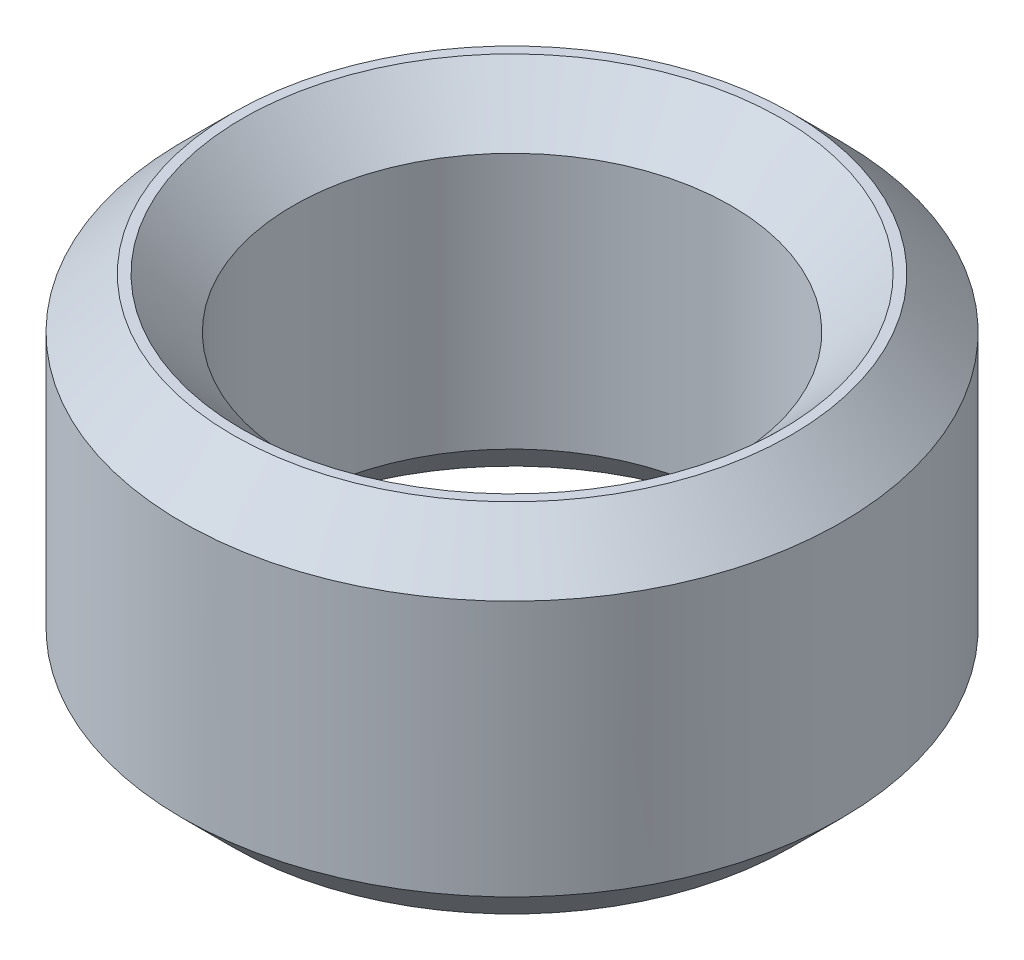
ISO-10303-21;
HEADER;
FILE_DESCRIPTION(('STEP AP214'),'2;1');
FILE_NAME('part.step','',(''),(''),'','','');
FILE_SCHEMA(('AUTOMOTIVE_DESIGN { 1 0 10303 214 1 1 1 1 }'));
ENDSEC;
DATA;
#1=APPLICATION_CONTEXT('core data for automotive mechanical design processes');
#2=APPLICATION_PROTOCOL_DEFINITION('international standard','automotive_design',2000,#1);
#3=PRODUCT_CONTEXT('',#1,'mechanical');
#4=PRODUCT('Part','Part','',(#3));
#5=PRODUCT_RELATED_PRODUCT_CATEGORY('part','',(#4));
#6=PRODUCT_DEFINITION_FORMATION('','',#4);
#7=PRODUCT_DEFINITION_CONTEXT('part definition',#1,'design');
#8=PRODUCT_DEFINITION('design','',#6,#7);
#9=PRODUCT_DEFINITION_SHAPE('','',#8);
#10=(LENGTH_UNIT() NAMED_UNIT(*) SI_UNIT(.MILLI.,.METRE.));
#11=(NAMED_UNIT(*) PLANE_ANGLE_UNIT() SI_UNIT($,.RADIAN.));
#12=(NAMED_UNIT(*) SI_UNIT($,.STERADIAN.) SOLID_ANGLE_UNIT());
#13=UNCERTAINTY_MEASURE_WITH_UNIT(LENGTH_MEASURE(1.E-05),#10,'distance_accuracy_value','');
#14=(GEOMETRIC_REPRESENTATION_CONTEXT(3) GLOBAL_UNCERTAINTY_ASSIGNED_CONTEXT((#13)) GLOBAL_UNIT_ASSIGNED_CONTEXT((#10,
#11,#12)) REPRESENTATION_CONTEXT('',''));
#15=CARTESIAN_POINT('',(0.,0.,0.));
#16=DIRECTION('',(0.,0.,1.));
#17=DIRECTION('',(1.,0.,0.));
#18=AXIS2_PLACEMENT_3D('',#15,#16,#17);
#19=CARTESIAN_POINT('',(0.,21.6633257304632,0.));
#20=DIRECTION('',(0.,-1.,0.));
#21=DIRECTION('',(0.,0.,-1.));
#22=AXIS2_PLACEMENT_3D('',#19,#20,#21);
#23=CYLINDRICAL_SURFACE('',#22,20.);
#24=CARTESIAN_POINT('',(0.,3.06001390784259,0.));
#25=DIRECTION('',(0.,1.,0.));
#26=DIRECTION('',(0.,0.,1.));
#27=AXIS2_PLACEMENT_3D('',#24,#25,#26);
#28=CIRCLE('',#27,20.);
#29=CARTESIAN_POINT('',(0.,3.06001390784259,-20.));
#30=VERTEX_POINT('',#29);
#31=EDGE_CURVE('E10',#30,#30,#28,.T.);
#32=CARTESIAN_POINT('',(0.,18.6033118226206,0.));
#33=DIRECTION('',(0.,1.,0.));
#34=DIRECTION('',(0.,0.,1.));
#35=AXIS2_PLACEMENT_3D('',#32,#33,#34);
#36=CIRCLE('',#35,20.);
#37=CARTESIAN_POINT('',(0.,18.6033118226206,-20.));
#38=VERTEX_POINT('',#37);
#39=EDGE_CURVE('E50',#38,#38,#36,.F.);
#40=CARTESIAN_POINT('',(0.,3.06001390784259,-20.));
#41=CARTESIAN_POINT('',(0.,3.22192326112152,-20.));
#42=CARTESIAN_POINT('',(0.,3.38383261440046,-20.));
#43=CARTESIAN_POINT('',(0.,3.70765132095834,-20.));
#44=CARTESIAN_POINT('',(0.,3.86956067423728,-20.));
#45=CARTESIAN_POINT('',(0.,4.19337938079515,-20.));
#46=CARTESIAN_POINT('',(0.,4.35528873407409,-20.));
#47=CARTESIAN_POINT('',(0.,4.67910744063197,-20.));
#48=CARTESIAN_POINT('',(0.,4.8410167939109,-20.));
#49=CARTESIAN_POINT('',(0.,5.16483550046878,-20.));
#50=CARTESIAN_POINT('',(0.,5.32674485374772,-20.));
#51=CARTESIAN_POINT('',(0.,5.65056356030559,-20.));
#52=CARTESIAN_POINT('',(0.,5.81247291358453,-20.));
#53=CARTESIAN_POINT('',(0.,6.13629162014241,-20.));
#54=CARTESIAN_POINT('',(0.,6.29820097342134,-20.));
#55=CARTESIAN_POINT('',(0.,6.62201967997922,-20.));
#56=CARTESIAN_POINT('',(0.,6.78392903325815,-20.));
#57=CARTESIAN_POINT('',(0.,7.10774773981603,-20.));
#58=CARTESIAN_POINT('',(0.,7.26965709309497,-20.));
#59=CARTESIAN_POINT('',(0.,7.59347579965284,-20.));
#60=CARTESIAN_POINT('',(0.,7.75538515293178,-20.));
#61=CARTESIAN_POINT('',(0.,8.07920385948966,-20.));
#62=CARTESIAN_POINT('',(0.,8.2411132127686,-20.));
#63=CARTESIAN_POINT('',(0.,8.56493191932647,-20.));
#64=CARTESIAN_POINT('',(0.,8.72684127260541,-20.));
#65=CARTESIAN_POINT('',(0.,9.05065997916329,-20.));
#66=CARTESIAN_POINT('',(0.,9.21256933244222,-20.));
#67=CARTESIAN_POINT('',(0.,9.5363880390001,-20.));
#68=CARTESIAN_POINT('',(0.,9.69829739227904,-20.));
#69=CARTESIAN_POINT('',(0.,10.0221160988369,-20.));
#70=CARTESIAN_POINT('',(0.,10.1840254521159,-20.));
#71=CARTESIAN_POINT('',(0.,10.5078441586737,-20.));
#72=CARTESIAN_POINT('',(0.,10.6697535119527,-20.));
#73=CARTESIAN_POINT('',(0.,10.9935722185105,-20.));
#74=CARTESIAN_POINT('',(0.,11.1554815717895,-20.));
#75=CARTESIAN_POINT('',(0.,11.4793002783474,-20.));
#76=CARTESIAN_POINT('',(0.,11.6412096316263,-20.));
#77=CARTESIAN_POINT('',(0.,11.9650283381842,-20.));
#78=CARTESIAN_POINT('',(0.,12.1269376914631,-20.));
#79=CARTESIAN_POINT('',(0.,12.450756398021,-20.));
#80=CARTESIAN_POINT('',(0.,12.6126657512999,-20.));
#81=CARTESIAN_POINT('',(0.,12.9364844578578,-20.));
#82=CARTESIAN_POINT('',(0.,13.0983938111367,-20.));
#83=CARTESIAN_POINT('',(0.,13.4222125176946,-20.));
#84=CARTESIAN_POINT('',(0.,13.5841218709735,-20.));
#85=CARTESIAN_POINT('',(0.,13.9079405775314,-20.));
#86=CARTESIAN_POINT('',(0.,14.0698499308104,-20.));
#87=CARTESIAN_POINT('',(0.,14.3936686373682,-20.));
#88=CARTESIAN_POINT('',(0.,14.5555779906472,-20.));
#89=CARTESIAN_POINT('',(0.,14.879396697205,-20.));
#90=CARTESIAN_POINT('',(0.,15.041306050484,-20.));
#91=CARTESIAN_POINT('',(0.,15.3651247570419,-20.));
#92=CARTESIAN_POINT('',(0.,15.5270341103208,-20.));
#93=CARTESIAN_POINT('',(0.,15.8508528168787,-20.));
#94=CARTESIAN_POINT('',(0.,16.0127621701576,-20.));
#95=CARTESIAN_POINT('',(0.,16.3365808767155,-20.));
#96=CARTESIAN_POINT('',(0.,16.4984902299944,-20.));
#97=CARTESIAN_POINT('',(0.,16.8223089365523,-20.));
#98=CARTESIAN_POINT('',(0.,16.9842182898312,-20.));
#99=CARTESIAN_POINT('',(0.,17.3080369963891,-20.));
#100=CARTESIAN_POINT('',(0.,17.4699463496681,-20.));
#101=CARTESIAN_POINT('',(0.,17.7937650562259,-20.));
#102=CARTESIAN_POINT('',(0.,17.9556744095049,-20.));
#103=CARTESIAN_POINT('',(0.,18.2794931160627,-20.));
#104=CARTESIAN_POINT('',(0.,18.4414024693417,-20.));
#105=CARTESIAN_POINT('',(0.,18.6033118226206,-20.));
#106=B_SPLINE_CURVE_WITH_KNOTS('',3,(#40,#41,#42,#43,#44,#45,#46,#47,#48,#49,#50,#51,#52,#53,
#54,#55,#56,#57,#58,#59,#60,#61,#62,#63,#64,#65,#66,#67,#68,#69,#70,#71,#72,#73,#74,#75,#76,#77,
#78,#79,#80,#81,#82,#83,#84,#85,#86,#87,#88,#89,#90,#91,#92,#93,#94,#95,#96,#97,#98,#99,#100,
#101,#102,#103,#104,#105),.UNSPECIFIED.,.F.,.F.,(4,2,2,2,2,2,2,2,2,2,2,2,2,2,2,2,2,2,2,2,2,2,2,
2,2,2,2,2,2,2,2,2,4),(0.,0.485728059836814,0.971456119673628,1.45718417951044,1.94291223934726,
2.42864029918407,2.91436835902088,3.40009641885769,3.88582447869451,4.37155253853132,
4.85728059836813,5.34300865820495,5.82873671804176,6.31446477787857,6.80019283771539,
7.2859208975522,7.77164895738902,8.25737701722583,8.74310507706264,9.22883313689946,
9.71456119673627,10.2002892565731,10.6860173164099,11.1717453762467,11.6574734360835,
12.1432014959203,12.6289295557571,13.114657615594,13.6003856754308,14.0861137352676,
14.5718417951044,15.0575698549412,15.543297914778),.UNSPECIFIED.);
#107=EDGE_CURVE('BSEAM39',#30,#38,#106,.T.);
#108=ORIENTED_EDGE('',*,*,#31,.T.);
#109=ORIENTED_EDGE('',*,*,#39,.T.);
#110=ORIENTED_EDGE('',*,*,#107,.T.);
#111=ORIENTED_EDGE('',*,*,#107,.F.);
#112=EDGE_LOOP('',(#108,#110,#109,#111));
#113=FACE_BOUND('',#112,.T.);
#114=ADVANCED_FACE('F39',(#113),#23,.T.);
#115=CARTESIAN_POINT('',(0.,21.6633257304632,0.));
#116=DIRECTION('',(0.,1.,0.));
#117=DIRECTION('',(0.,0.,1.));
#118=AXIS2_PLACEMENT_3D('',#115,#116,#117);
#119=PLANE('',#118);
#120=CARTESIAN_POINT('',(0.,21.6633257304632,0.));
#121=DIRECTION('',(0.,1.,0.));
#122=DIRECTION('',(0.,0.,1.));
#123=AXIS2_PLACEMENT_3D('',#120,#121,#122);
#124=CIRCLE('',#123,16.3518396871364);
#125=CARTESIAN_POINT('',(0.,21.6633257304632,16.3518396871364));
#126=VERTEX_POINT('',#125);
#127=EDGE_CURVE('E58',#126,#126,#124,.F.);
#128=ORIENTED_EDGE('',*,*,#127,.T.);
#129=EDGE_LOOP('',(#128));
#130=FACE_BOUND('',#129,.T.);
#131=CARTESIAN_POINT('',(0.,21.6633257304632,0.));
#132=DIRECTION('',(0.,1.,0.));
#133=DIRECTION('',(0.,0.,1.));
#134=AXIS2_PLACEMENT_3D('',#131,#132,#133);
#135=CIRCLE('',#134,16.9399860921575);
#136=CARTESIAN_POINT('',(0.,21.6633257304632,-16.9399860921575));
#137=VERTEX_POINT('',#136);
#138=EDGE_CURVE('E61',#137,#137,#135,.T.);
#139=ORIENTED_EDGE('',*,*,#138,.T.);
#140=EDGE_LOOP('',(#139));
#141=FACE_BOUND('',#140,.T.);
#142=ADVANCED_FACE('F88',(#130,#141),#119,.T.);
#143=CARTESIAN_POINT('',(0.,0.,0.));
#144=DIRECTION('',(0.,1.,0.));
#145=DIRECTION('',(0.,0.,1.));
#146=AXIS2_PLACEMENT_3D('',#143,#144,#145);
#147=PLANE('',#146);
#148=CARTESIAN_POINT('',(0.,0.,0.));
#149=DIRECTION('',(0.,1.,0.));
#150=DIRECTION('',(0.,0.,1.));
#151=AXIS2_PLACEMENT_3D('',#148,#149,#150);
#152=CIRCLE('',#151,16.3518396871363);
#153=CARTESIAN_POINT('',(0.,0.,-16.3518396871363));
#154=VERTEX_POINT('',#153);
#155=EDGE_CURVE('E51',#154,#154,#152,.T.);
#156=ORIENTED_EDGE('',*,*,#155,.T.);
#157=EDGE_LOOP('',(#156));
#158=FACE_BOUND('',#157,.T.);
#159=CARTESIAN_POINT('',(0.,0.,0.));
#160=DIRECTION('',(0.,1.,0.));
#161=DIRECTION('',(0.,0.,1.));
#162=AXIS2_PLACEMENT_3D('',#159,#160,#161);
#163=CIRCLE('',#162,16.9399860921574);
#164=CARTESIAN_POINT('',(0.,0.,16.9399860921574));
#165=VERTEX_POINT('',#164);
#166=EDGE_CURVE('E54',#165,#165,#163,.F.);
#167=ORIENTED_EDGE('',*,*,#166,.T.);
#168=EDGE_LOOP('',(#167));
#169=FACE_BOUND('',#168,.T.);
#170=ADVANCED_FACE('F83',(#158,#169),#147,.F.);
#171=CARTESIAN_POINT('',(0.,21.6633257304632,0.));
#172=DIRECTION('',(0.,-1.,0.));
#173=DIRECTION('',(0.,0.,-1.));
#174=AXIS2_PLACEMENT_3D('',#171,#172,#173);
#175=CYLINDRICAL_SURFACE('',#174,13.2918257792938);
#176=CARTESIAN_POINT('',(0.,18.6033118226206,0.));
#177=DIRECTION('',(0.,1.,0.));
#178=DIRECTION('',(0.,0.,1.));
#179=AXIS2_PLACEMENT_3D('',#176,#177,#178);
#180=CIRCLE('',#179,13.2918257792938);
#181=CARTESIAN_POINT('',(0.,18.6033118226206,-13.2918257792938));
#182=VERTEX_POINT('',#181);
#183=EDGE_CURVE('E67',#182,#182,#180,.T.);
#184=CARTESIAN_POINT('',(0.,3.06001390784257,0.));
#185=DIRECTION('',(0.,1.,0.));
#186=DIRECTION('',(0.,0.,1.));
#187=AXIS2_PLACEMENT_3D('',#184,#185,#186);
#188=CIRCLE('',#187,13.2918257792938);
#189=CARTESIAN_POINT('',(0.,3.06001390784257,-13.2918257792938));
#190=VERTEX_POINT('',#189);
#191=EDGE_CURVE('E69',#190,#190,#188,.F.);
#192=CARTESIAN_POINT('',(0.,18.6033118226206,-13.2918257792938));
#193=CARTESIAN_POINT('',(0.,18.4414024693416,-13.2918257792938));
#194=CARTESIAN_POINT('',(0.,18.2794931160627,-13.2918257792938));
#195=CARTESIAN_POINT('',(0.,17.9556744095048,-13.2918257792938));
#196=CARTESIAN_POINT('',(0.,17.7937650562259,-13.2918257792938));
#197=CARTESIAN_POINT('',(0.,17.469946349668,-13.2918257792938));
#198=CARTESIAN_POINT('',(0.,17.3080369963891,-13.2918257792938));
#199=CARTESIAN_POINT('',(0.,16.9842182898312,-13.2918257792938));
#200=CARTESIAN_POINT('',(0.,16.8223089365523,-13.2918257792938));
#201=CARTESIAN_POINT('',(0.,16.4984902299944,-13.2918257792938));
#202=CARTESIAN_POINT('',(0.,16.3365808767155,-13.2918257792938));
#203=CARTESIAN_POINT('',(0.,16.0127621701576,-13.2918257792938));
#204=CARTESIAN_POINT('',(0.,15.8508528168786,-13.2918257792938));
#205=CARTESIAN_POINT('',(0.,15.5270341103208,-13.2918257792938));
#206=CARTESIAN_POINT('',(0.,15.3651247570418,-13.2918257792938));
#207=CARTESIAN_POINT('',(0.,15.041306050484,-13.2918257792938));
#208=CARTESIAN_POINT('',(0.,14.879396697205,-13.2918257792938));
#209=CARTESIAN_POINT('',(0.,14.5555779906471,-13.2918257792938));
#210=CARTESIAN_POINT('',(0.,14.3936686373682,-13.2918257792938));
#211=CARTESIAN_POINT('',(0.,14.0698499308103,-13.2918257792938));
#212=CARTESIAN_POINT('',(0.,13.9079405775314,-13.2918257792938));
#213=CARTESIAN_POINT('',(0.,13.5841218709735,-13.2918257792938));
#214=CARTESIAN_POINT('',(0.,13.4222125176946,-13.2918257792938));
#215=CARTESIAN_POINT('',(0.,13.0983938111367,-13.2918257792938));
#216=CARTESIAN_POINT('',(0.,12.9364844578578,-13.2918257792938));
#217=CARTESIAN_POINT('',(0.,12.6126657512999,-13.2918257792938));
#218=CARTESIAN_POINT('',(0.,12.4507563980209,-13.2918257792938));
#219=CARTESIAN_POINT('',(0.,12.1269376914631,-13.2918257792938));
#220=CARTESIAN_POINT('',(0.,11.9650283381841,-13.2918257792938));
#221=CARTESIAN_POINT('',(0.,11.6412096316263,-13.2918257792938));
#222=CARTESIAN_POINT('',(0.,11.4793002783473,-13.2918257792938));
#223=CARTESIAN_POINT('',(0.,11.1554815717894,-13.2918257792938));
#224=CARTESIAN_POINT('',(0.,10.9935722185105,-13.2918257792938));
#225=CARTESIAN_POINT('',(0.,10.6697535119526,-13.2918257792938));
#226=CARTESIAN_POINT('',(0.,10.5078441586737,-13.2918257792938));
#227=CARTESIAN_POINT('',(0.,10.1840254521158,-13.2918257792938));
#228=CARTESIAN_POINT('',(0.,10.0221160988369,-13.2918257792938));
#229=CARTESIAN_POINT('',(0.,9.69829739227901,-13.2918257792938));
#230=CARTESIAN_POINT('',(0.,9.53638803900007,-13.2918257792938));
#231=CARTESIAN_POINT('',(0.,9.2125693324422,-13.2918257792938));
#232=CARTESIAN_POINT('',(0.,9.05065997916326,-13.2918257792938));
#233=CARTESIAN_POINT('',(0.,8.72684127260538,-13.2918257792938));
#234=CARTESIAN_POINT('',(0.,8.56493191932645,-13.2918257792938));
#235=CARTESIAN_POINT('',(0.,8.24111321276857,-13.2918257792938));
#236=CARTESIAN_POINT('',(0.,8.07920385948963,-13.2918257792938));
#237=CARTESIAN_POINT('',(0.,7.75538515293176,-13.2918257792938));
#238=CARTESIAN_POINT('',(0.,7.59347579965282,-13.2918257792938));
#239=CARTESIAN_POINT('',(0.,7.26965709309494,-13.2918257792938));
#240=CARTESIAN_POINT('',(0.,7.10774773981601,-13.2918257792938));
#241=CARTESIAN_POINT('',(0.,6.78392903325813,-13.2918257792938));
#242=CARTESIAN_POINT('',(0.,6.62201967997919,-13.2918257792938));
#243=CARTESIAN_POINT('',(0.,6.29820097342132,-13.2918257792938));
#244=CARTESIAN_POINT('',(0.,6.13629162014238,-13.2918257792938));
#245=CARTESIAN_POINT('',(0.,5.81247291358451,-13.2918257792938));
#246=CARTESIAN_POINT('',(0.,5.65056356030557,-13.2918257792938));
#247=CARTESIAN_POINT('',(0.,5.32674485374769,-13.2918257792938));
#248=CARTESIAN_POINT('',(0.,5.16483550046876,-13.2918257792938));
#249=CARTESIAN_POINT('',(0.,4.84101679391088,-13.2918257792938));
#250=CARTESIAN_POINT('',(0.,4.67910744063194,-13.2918257792938));
#251=CARTESIAN_POINT('',(0.,4.35528873407407,-13.2918257792938));
#252=CARTESIAN_POINT('',(0.,4.19337938079513,-13.2918257792938));
#253=CARTESIAN_POINT('',(0.,3.86956067423725,-13.2918257792938));
#254=CARTESIAN_POINT('',(0.,3.70765132095832,-13.2918257792938));
#255=CARTESIAN_POINT('',(0.,3.38383261440044,-13.2918257792938));
#256=CARTESIAN_POINT('',(0.,3.2219232611215,-13.2918257792938));
#257=CARTESIAN_POINT('',(0.,3.06001390784257,-13.2918257792938));
#258=B_SPLINE_CURVE_WITH_KNOTS('',3,(#192,#193,#194,#195,#196,#197,#198,#199,#200,#201,#202,
#203,#204,#205,#206,#207,#208,#209,#210,#211,#212,#213,#214,#215,#216,#217,#218,#219,#220,#221,
#222,#223,#224,#225,#226,#227,#228,#229,#230,#231,#232,#233,#234,#235,#236,#237,#238,#239,#240,
#241,#242,#243,#244,#245,#246,#247,#248,#249,#250,#251,#252,#253,#254,#255,#256,#257),
.UNSPECIFIED.,.F.,.F.,(4,2,2,2,2,2,2,2,2,2,2,2,2,2,2,2,2,2,2,2,2,2,2,2,2,2,2,2,2,2,2,2,4),(0.,
0.485728059836814,0.971456119673628,1.45718417951044,1.94291223934725,2.42864029918407,
2.91436835902088,3.40009641885769,3.88582447869451,4.37155253853132,4.85728059836813,
5.34300865820494,5.82873671804176,6.31446477787857,6.80019283771539,7.2859208975522,
7.77164895738901,8.25737701722582,8.74310507706264,9.22883313689945,9.71456119673626,
10.2002892565731,10.6860173164099,11.1717453762467,11.6574734360835,12.1432014959203,
12.6289295557571,13.114657615594,13.6003856754308,14.0861137352676,14.5718417951044,
15.0575698549412,15.543297914778),.UNSPECIFIED.);
#259=EDGE_CURVE('BSEAM71',#182,#190,#258,.T.);
#260=ORIENTED_EDGE('',*,*,#183,.T.);
#261=ORIENTED_EDGE('',*,*,#191,.T.);
#262=ORIENTED_EDGE('',*,*,#259,.T.);
#263=ORIENTED_EDGE('',*,*,#259,.F.);
#264=EDGE_LOOP('',(#260,#262,#261,#263));
#265=FACE_BOUND('',#264,.T.);
#266=ADVANCED_FACE('F71',(#265),#175,.F.);
#267=CARTESIAN_POINT('',(0.,18.6033118226206,0.));
#268=DIRECTION('',(0.,1.,0.));
#269=DIRECTION('',(0.,0.,1.));
#270=AXIS2_PLACEMENT_3D('',#267,#268,#269);
#271=CONICAL_SURFACE('',#270,13.2918257792938,0.785398163397452);
#272=ORIENTED_EDGE('',*,*,#127,.F.);
#273=EDGE_LOOP('',(#272));
#274=FACE_BOUND('',#273,.T.);
#275=ORIENTED_EDGE('',*,*,#183,.F.);
#276=EDGE_LOOP('',(#275));
#277=FACE_BOUND('',#276,.T.);
#278=ADVANCED_FACE('F77',(#274,#277),#271,.F.);
#279=CARTESIAN_POINT('',(0.,0.,0.));
#280=DIRECTION('',(0.,-1.,0.));
#281=DIRECTION('',(0.,0.,-1.));
#282=AXIS2_PLACEMENT_3D('',#279,#280,#281);
#283=CONICAL_SURFACE('',#282,16.3518396871363,0.785398163397444);
#284=CARTESIAN_POINT('',(0.,3.06001390784257,-13.2918257792938));
#285=CARTESIAN_POINT('',(0.,3.02813876296921,-13.3237009241672));
#286=CARTESIAN_POINT('',(0.,2.99626361809585,-13.3555760690405));
#287=CARTESIAN_POINT('',(0.,2.93251332834913,-13.4193263587872));
#288=CARTESIAN_POINT('',(0.,2.90063818347577,-13.4512015036606));
#289=CARTESIAN_POINT('',(0.,2.83688789372905,-13.5149517934073));
#290=CARTESIAN_POINT('',(0.,2.80501274885569,-13.5468269382807));
#291=CARTESIAN_POINT('',(0.,2.74126245910897,-13.6105772280274));
#292=CARTESIAN_POINT('',(0.,2.70938731423561,-13.6424523729008));
#293=CARTESIAN_POINT('',(0.,2.64563702448889,-13.7062026626475));
#294=CARTESIAN_POINT('',(0.,2.61376187961553,-13.7380778075208));
#295=CARTESIAN_POINT('',(0.,2.55001158986881,-13.8018280972676));
#296=CARTESIAN_POINT('',(0.,2.51813644499545,-13.8337032421409));
#297=CARTESIAN_POINT('',(0.,2.45438615524873,-13.8974535318876));
#298=CARTESIAN_POINT('',(0.,2.42251101037537,-13.929328676761));
#299=CARTESIAN_POINT('',(0.,2.35876072062865,-13.9930789665077));
#300=CARTESIAN_POINT('',(0.,2.32688557575529,-14.0249541113811));
#301=CARTESIAN_POINT('',(0.,2.26313528600857,-14.0887044011278));
#302=CARTESIAN_POINT('',(0.,2.23126014113521,-14.1205795460012));
#303=CARTESIAN_POINT('',(0.,2.16750985138849,-14.1843298357479));
#304=CARTESIAN_POINT('',(0.,2.13563470651513,-14.2162049806212));
#305=CARTESIAN_POINT('',(0.,2.07188441676841,-14.279955270368));
#306=CARTESIAN_POINT('',(0.,2.04000927189505,-14.3118304152413));
#307=CARTESIAN_POINT('',(0.,1.97625898214833,-14.375580704988));
#308=CARTESIAN_POINT('',(0.,1.94438383727497,-14.4074558498614));
#309=CARTESIAN_POINT('',(0.,1.88063354752825,-14.4712061396081));
#310=CARTESIAN_POINT('',(0.,1.84875840265489,-14.5030812844815));
#311=CARTESIAN_POINT('',(0.,1.78500811290816,-14.5668315742282));
#312=CARTESIAN_POINT('',(0.,1.7531329680348,-14.5987067191015));
#313=CARTESIAN_POINT('',(0.,1.68938267828808,-14.6624570088483));
#314=CARTESIAN_POINT('',(0.,1.65750753341472,-14.6943321537216));
#315=CARTESIAN_POINT('',(0.,1.593757243668,-14.7580824434683));
#316=CARTESIAN_POINT('',(0.,1.56188209879464,-14.7899575883417));
#317=CARTESIAN_POINT('',(0.,1.49813180904792,-14.8537078780884));
#318=CARTESIAN_POINT('',(0.,1.46625666417456,-14.8855830229618));
#319=CARTESIAN_POINT('',(0.,1.40250637442784,-14.9493333127085));
#320=CARTESIAN_POINT('',(0.,1.37063122955448,-14.9812084575819));
#321=CARTESIAN_POINT('',(0.,1.30688093980776,-15.0449587473286));
#322=CARTESIAN_POINT('',(0.,1.2750057949344,-15.0768338922019));
#323=CARTESIAN_POINT('',(0.,1.21125550518768,-15.1405841819487));
#324=CARTESIAN_POINT('',(0.,1.17938036031432,-15.172459326822));
#325=CARTESIAN_POINT('',(0.,1.1156300705676,-15.2362096165687));
#326=CARTESIAN_POINT('',(0.,1.08375492569424,-15.2680847614421));
#327=CARTESIAN_POINT('',(0.,1.02000463594752,-15.3318350511888));
#328=CARTESIAN_POINT('',(0.,0.988129491074163,-15.3637101960622));
#329=CARTESIAN_POINT('',(0.,0.924379201327442,-15.4274604858089));
#330=CARTESIAN_POINT('',(0.,0.892504056454082,-15.4593356306823));
#331=CARTESIAN_POINT('',(0.,0.828753766707362,-15.523085920429));
#332=CARTESIAN_POINT('',(0.,0.796878621834002,-15.5549610653023));
#333=CARTESIAN_POINT('',(0.,0.733128332087282,-15.6187113550491));
#334=CARTESIAN_POINT('',(0.,0.701253187213922,-15.6505864999224));
#335=CARTESIAN_POINT('',(0.,0.637502897467202,-15.7143367896691));
#336=CARTESIAN_POINT('',(0.,0.605627752593841,-15.7462119345425));
#337=CARTESIAN_POINT('',(0.,0.541877462847121,-15.8099622242892));
#338=CARTESIAN_POINT('',(0.,0.510002317973762,-15.8418373691626));
#339=CARTESIAN_POINT('',(0.,0.446252028227041,-15.9055876589093));
#340=CARTESIAN_POINT('',(0.,0.414376883353681,-15.9374628037827));
#341=CARTESIAN_POINT('',(0.,0.350626593606961,-16.0012130935294));
#342=CARTESIAN_POINT('',(0.,0.318751448733601,-16.0330882384027));
#343=CARTESIAN_POINT('',(0.,0.255001158986881,-16.0968385281495));
#344=CARTESIAN_POINT('',(0.,0.22312601411352,-16.1287136730228));
#345=CARTESIAN_POINT('',(0.,0.1593757243668,-16.1924639627695));
#346=CARTESIAN_POINT('',(0.,0.12750057949344,-16.2243391076429));
#347=CARTESIAN_POINT('',(0.,0.0637502897467208,-16.2880893973896));
#348=CARTESIAN_POINT('',(0.,0.0318751448733611,-16.319964542263));
#349=CARTESIAN_POINT('',(0.,0.,-16.3518396871363));
#350=B_SPLINE_CURVE_WITH_KNOTS('',3,(#284,#285,#286,#287,#288,#289,#290,#291,#292,#293,#294,
#295,#296,#297,#298,#299,#300,#301,#302,#303,#304,#305,#306,#307,#308,#309,#310,#311,#312,#313,
#314,#315,#316,#317,#318,#319,#320,#321,#322,#323,#324,#325,#326,#327,#328,#329,#330,#331,#332,
#333,#334,#335,#336,#337,#338,#339,#340,#341,#342,#343,#344,#345,#346,#347,#348,#349),
.UNSPECIFIED.,.F.,.F.,(4,2,2,2,2,2,2,2,2,2,2,2,2,2,2,2,2,2,2,2,2,2,2,2,2,2,2,2,2,2,2,2,4),(0.,
0.135234786547539,0.270469573095076,0.405704359642617,0.540939146190154,0.676173932737693,
0.811408719285232,0.94664350583277,1.08187829238031,1.21711307892785,1.35234786547539,
1.48758265202292,1.62281743857046,1.758052225118,1.89328701166554,2.02852179821308,
2.16375658476062,2.29899137130816,2.4342261578557,2.56946094440323,2.70469573095077,
2.83993051749831,2.97516530404585,3.11040009059339,3.24563487714093,3.38086966368847,
3.516104450236,3.65133923678354,3.78657402333108,3.92180880987862,4.05704359642616,
4.1922783829737,4.32751316952124),.UNSPECIFIED.);
#351=EDGE_CURVE('BSEAM73',#190,#154,#350,.T.);
#352=ORIENTED_EDGE('',*,*,#191,.F.);
#353=ORIENTED_EDGE('',*,*,#155,.F.);
#354=ORIENTED_EDGE('',*,*,#351,.T.);
#355=ORIENTED_EDGE('',*,*,#351,.F.);
#356=EDGE_LOOP('',(#352,#354,#353,#355));
#357=FACE_BOUND('',#356,.T.);
#358=ADVANCED_FACE('F73',(#357),#283,.F.);
#359=CARTESIAN_POINT('',(0.,3.06001390784259,0.));
#360=DIRECTION('',(0.,1.,0.));
#361=DIRECTION('',(0.,0.,1.));
#362=AXIS2_PLACEMENT_3D('',#359,#360,#361);
#363=CONICAL_SURFACE('',#362,20.,0.785398163397451);
#364=ORIENTED_EDGE('',*,*,#166,.F.);
#365=EDGE_LOOP('',(#364));
#366=FACE_BOUND('',#365,.T.);
#367=ORIENTED_EDGE('',*,*,#31,.F.);
#368=EDGE_LOOP('',(#367));
#369=FACE_BOUND('',#368,.T.);
#370=ADVANCED_FACE('F76',(#366,#369),#363,.T.);
#371=CARTESIAN_POINT('',(0.,21.6633257304632,0.));
#372=DIRECTION('',(0.,-1.,0.));
#373=DIRECTION('',(0.,0.,-1.));
#374=AXIS2_PLACEMENT_3D('',#371,#372,#373);
#375=CONICAL_SURFACE('',#374,16.9399860921575,0.785398163397444);
#376=CARTESIAN_POINT('',(0.,18.6033118226206,-20.));
#377=CARTESIAN_POINT('',(0.,18.635186967494,-19.9681248551266));
#378=CARTESIAN_POINT('',(0.,18.6670621123673,-19.9362497102533));
#379=CARTESIAN_POINT('',(0.,18.7308124021141,-19.8724994205066));
#380=CARTESIAN_POINT('',(0.,18.7626875469874,-19.8406242756332));
#381=CARTESIAN_POINT('',(0.,18.8264378367341,-19.7768739858865));
#382=CARTESIAN_POINT('',(0.,18.8583129816075,-19.7449988410131));
#383=CARTESIAN_POINT('',(0.,18.9220632713542,-19.6812485512664));
#384=CARTESIAN_POINT('',(0.,18.9539384162276,-19.649373406393));
#385=CARTESIAN_POINT('',(0.,19.0176887059743,-19.5856231166463));
#386=CARTESIAN_POINT('',(0.,19.0495638508477,-19.553747971773));
#387=CARTESIAN_POINT('',(0.,19.1133141405944,-19.4899976820262));
#388=CARTESIAN_POINT('',(0.,19.1451892854677,-19.4581225371529));
#389=CARTESIAN_POINT('',(0.,19.2089395752145,-19.3943722474062));
#390=CARTESIAN_POINT('',(0.,19.2408147200878,-19.3624971025328));
#391=CARTESIAN_POINT('',(0.,19.3045650098345,-19.2987468127861));
#392=CARTESIAN_POINT('',(0.,19.3364401547079,-19.2668716679127));
#393=CARTESIAN_POINT('',(0.,19.4001904444546,-19.203121378166));
#394=CARTESIAN_POINT('',(0.,19.432065589328,-19.1712462332927));
#395=CARTESIAN_POINT('',(0.,19.4958158790747,-19.1074959435459));
#396=CARTESIAN_POINT('',(0.,19.5276910239481,-19.0756207986726));
#397=CARTESIAN_POINT('',(0.,19.5914413136948,-19.0118705089259));
#398=CARTESIAN_POINT('',(0.,19.6233164585681,-18.9799953640525));
#399=CARTESIAN_POINT('',(0.,19.6870667483149,-18.9162450743058));
#400=CARTESIAN_POINT('',(0.,19.7189418931882,-18.8843699294324));
#401=CARTESIAN_POINT('',(0.,19.7826921829349,-18.8206196396857));
#402=CARTESIAN_POINT('',(0.,19.8145673278083,-18.7887444948123));
#403=CARTESIAN_POINT('',(0.,19.878317617555,-18.7249942050656));
#404=CARTESIAN_POINT('',(0.,19.9101927624284,-18.6931190601923));
#405=CARTESIAN_POINT('',(0.,19.9739430521751,-18.6293687704455));
#406=CARTESIAN_POINT('',(0.,20.0058181970485,-18.5974936255722));
#407=CARTESIAN_POINT('',(0.,20.0695684867952,-18.5337433358255));
#408=CARTESIAN_POINT('',(0.,20.1014436316685,-18.5018681909521));
#409=CARTESIAN_POINT('',(0.,20.1651939214153,-18.4381179012054));
#410=CARTESIAN_POINT('',(0.,20.1970690662886,-18.406242756332));
#411=CARTESIAN_POINT('',(0.,20.2608193560353,-18.3424924665853));
#412=CARTESIAN_POINT('',(0.,20.2926945009087,-18.3106173217119));
#413=CARTESIAN_POINT('',(0.,20.3564447906554,-18.2468670319652));
#414=CARTESIAN_POINT('',(0.,20.3883199355288,-18.2149918870919));
#415=CARTESIAN_POINT('',(0.,20.4520702252755,-18.1512415973451));
#416=CARTESIAN_POINT('',(0.,20.4839453701489,-18.1193664524718));
#417=CARTESIAN_POINT('',(0.,20.5476956598956,-18.0556161627251));
#418=CARTESIAN_POINT('',(0.,20.5795708047689,-18.0237410178517));
#419=CARTESIAN_POINT('',(0.,20.6433210945157,-17.959990728105));
#420=CARTESIAN_POINT('',(0.,20.675196239389,-17.9281155832316));
#421=CARTESIAN_POINT('',(0.,20.7389465291357,-17.8643652934849));
#422=CARTESIAN_POINT('',(0.,20.7708216740091,-17.8324901486115));
#423=CARTESIAN_POINT('',(0.,20.8345719637558,-17.7687398588648));
#424=CARTESIAN_POINT('',(0.,20.8664471086292,-17.7368647139915));
#425=CARTESIAN_POINT('',(0.,20.9301973983759,-17.6731144242448));
#426=CARTESIAN_POINT('',(0.,20.9620725432492,-17.6412392793714));
#427=CARTESIAN_POINT('',(0.,21.025822832996,-17.5774889896247));
#428=CARTESIAN_POINT('',(0.,21.0576979778693,-17.5456138447513));
#429=CARTESIAN_POINT('',(0.,21.1214482676161,-17.4818635550046));
#430=CARTESIAN_POINT('',(0.,21.1533234124894,-17.4499884101312));
#431=CARTESIAN_POINT('',(0.,21.2170737022361,-17.3862381203845));
#432=CARTESIAN_POINT('',(0.,21.2489488471095,-17.3543629755112));
#433=CARTESIAN_POINT('',(0.,21.3126991368562,-17.2906126857644));
#434=CARTESIAN_POINT('',(0.,21.3445742817296,-17.2587375408911));
#435=CARTESIAN_POINT('',(0.,21.4083245714763,-17.1949872511444));
#436=CARTESIAN_POINT('',(0.,21.4401997163496,-17.163112106271));
#437=CARTESIAN_POINT('',(0.,21.5039500060964,-17.0993618165243));
#438=CARTESIAN_POINT('',(0.,21.5358251509697,-17.0674866716509));
#439=CARTESIAN_POINT('',(0.,21.5995754407164,-17.0037363819042));
#440=CARTESIAN_POINT('',(0.,21.6314505855898,-16.9718612370308));
#441=CARTESIAN_POINT('',(0.,21.6633257304632,-16.9399860921575));
#442=B_SPLINE_CURVE_WITH_KNOTS('',3,(#376,#377,#378,#379,#380,#381,#382,#383,#384,#385,#386,
#387,#388,#389,#390,#391,#392,#393,#394,#395,#396,#397,#398,#399,#400,#401,#402,#403,#404,#405,
#406,#407,#408,#409,#410,#411,#412,#413,#414,#415,#416,#417,#418,#419,#420,#421,#422,#423,#424,
#425,#426,#427,#428,#429,#430,#431,#432,#433,#434,#435,#436,#437,#438,#439,#440,#441),
.UNSPECIFIED.,.F.,.F.,(4,2,2,2,2,2,2,2,2,2,2,2,2,2,2,2,2,2,2,2,2,2,2,2,2,2,2,2,2,2,2,2,4),(0.,
0.135234786547538,0.270469573095077,0.405704359642613,0.540939146190154,0.67617393273769,
0.811408719285228,0.946643505832764,1.0818782923803,1.21711307892784,1.35234786547538,
1.48758265202292,1.62281743857046,1.75805222511799,1.89328701166553,2.02852179821307,
2.16375658476061,2.29899137130814,2.43422615785568,2.56946094440322,2.70469573095076,
2.8399305174983,2.97516530404583,3.11040009059337,3.24563487714091,3.38086966368845,
3.51610445023599,3.65133923678352,3.78657402333106,3.9218088098786,4.05704359642614,
4.19227838297367,4.32751316952121),.UNSPECIFIED.);
#443=EDGE_CURVE('BSEAM45',#38,#137,#442,.T.);
#444=ORIENTED_EDGE('',*,*,#39,.F.);
#445=ORIENTED_EDGE('',*,*,#138,.F.);
#446=ORIENTED_EDGE('',*,*,#443,.T.);
#447=ORIENTED_EDGE('',*,*,#443,.F.);
#448=EDGE_LOOP('',(#444,#446,#445,#447));
#449=FACE_BOUND('',#448,.T.);
#450=ADVANCED_FACE('F45',(#449),#375,.T.);
#451=CLOSED_SHELL('',(#114,#142,#170,#266,#278,#358,#370,#450));
#452=MANIFOLD_SOLID_BREP('B2',#451);
#453=ADVANCED_BREP_SHAPE_REPRESENTATION('',(#18,#452),#14);
#454=SHAPE_DEFINITION_REPRESENTATION(#9,#453);
ENDSEC;
END-ISO-10303-21;
